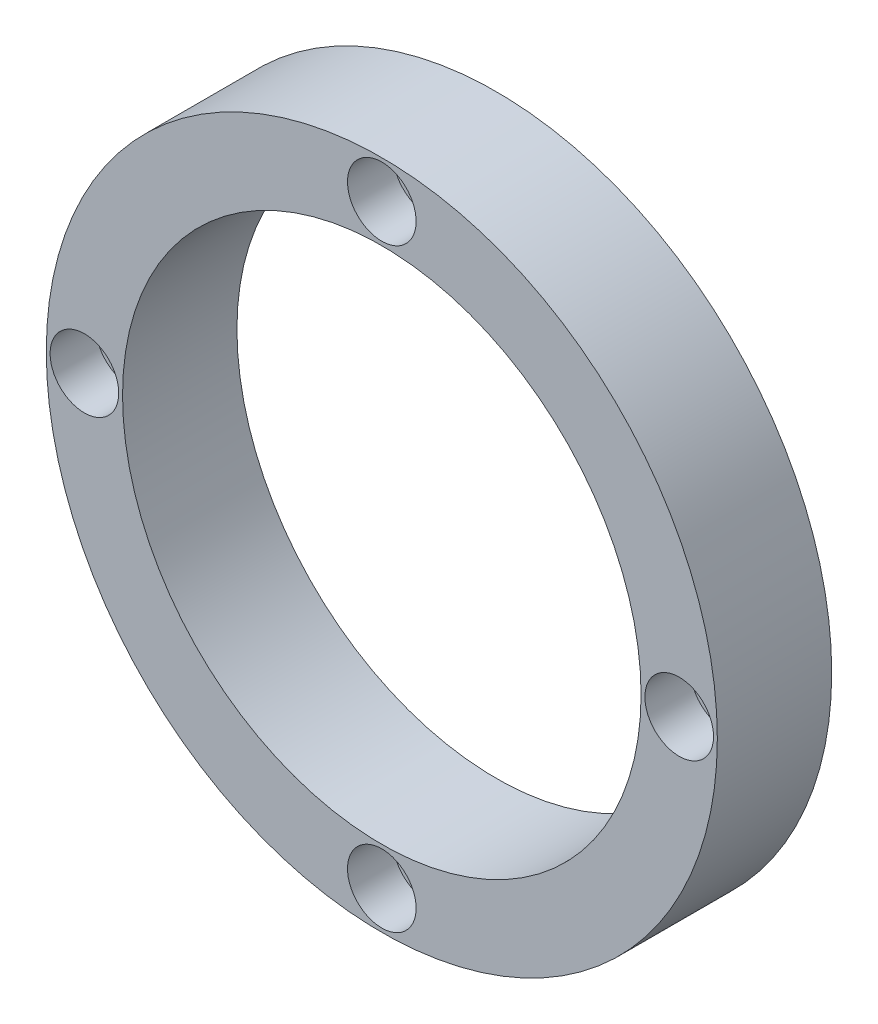
ISO-10303-21;
HEADER;
FILE_DESCRIPTION(('STEP AP214'),'2;1');
FILE_NAME('part.step','',(''),(''),'','','');
FILE_SCHEMA(('AUTOMOTIVE_DESIGN { 1 0 10303 214 1 1 1 1 }'));
ENDSEC;
DATA;
#1=APPLICATION_CONTEXT('core data for automotive mechanical design processes');
#2=APPLICATION_PROTOCOL_DEFINITION('international standard','automotive_design',2000,#1);
#3=PRODUCT_CONTEXT('',#1,'mechanical');
#4=PRODUCT('Part','Part','',(#3));
#5=PRODUCT_RELATED_PRODUCT_CATEGORY('part','',(#4));
#6=PRODUCT_DEFINITION_FORMATION('','',#4);
#7=PRODUCT_DEFINITION_CONTEXT('part definition',#1,'design');
#8=PRODUCT_DEFINITION('design','',#6,#7);
#9=PRODUCT_DEFINITION_SHAPE('','',#8);
#10=(LENGTH_UNIT() NAMED_UNIT(*) SI_UNIT(.MILLI.,.METRE.));
#11=(NAMED_UNIT(*) PLANE_ANGLE_UNIT() SI_UNIT($,.RADIAN.));
#12=(NAMED_UNIT(*) SI_UNIT($,.STERADIAN.) SOLID_ANGLE_UNIT());
#13=UNCERTAINTY_MEASURE_WITH_UNIT(LENGTH_MEASURE(1.E-05),#10,'distance_accuracy_value','');
#14=(GEOMETRIC_REPRESENTATION_CONTEXT(3) GLOBAL_UNCERTAINTY_ASSIGNED_CONTEXT((#13)) GLOBAL_UNIT_ASSIGNED_CONTEXT((#10,
#11,#12)) REPRESENTATION_CONTEXT('',''));
#15=CARTESIAN_POINT('',(0.,0.,0.));
#16=DIRECTION('',(0.,0.,1.));
#17=DIRECTION('',(1.,0.,0.));
#18=AXIS2_PLACEMENT_3D('',#15,#16,#17);
#19=CARTESIAN_POINT('',(0.,0.,15.));
#20=DIRECTION('',(0.,0.,1.));
#21=DIRECTION('',(1.,0.,0.));
#22=AXIS2_PLACEMENT_3D('',#19,#20,#21);
#23=PLANE('',#22);
#24=CARTESIAN_POINT('',(4.08503553249798E-13,39.,15.));
#25=DIRECTION('',(0.,0.,1.));
#26=DIRECTION('',(0.,1.,0.));
#27=AXIS2_PLACEMENT_3D('',#24,#25,#26);
#28=CIRCLE('',#27,4.5);
#29=CARTESIAN_POINT('',(4.55638578624774E-13,43.5,15.));
#30=VERTEX_POINT('',#29);
#31=EDGE_CURVE('E73',#30,#30,#28,.T.);
#32=ORIENTED_EDGE('',*,*,#31,.F.);
#33=EDGE_LOOP('',(#32));
#34=FACE_BOUND('',#33,.T.);
#35=CARTESIAN_POINT('',(-39.,0.,15.));
#36=DIRECTION('',(0.,0.,1.));
#37=DIRECTION('',(-1.,0.,0.));
#38=AXIS2_PLACEMENT_3D('',#35,#36,#37);
#39=CIRCLE('',#38,4.5);
#40=CARTESIAN_POINT('',(-43.5,0.,15.));
#41=VERTEX_POINT('',#40);
#42=EDGE_CURVE('E67',#41,#41,#39,.T.);
#43=ORIENTED_EDGE('',*,*,#42,.F.);
#44=EDGE_LOOP('',(#43));
#45=FACE_BOUND('',#44,.T.);
#46=CARTESIAN_POINT('',(-1.36167851083266E-13,-39.,15.));
#47=DIRECTION('',(0.,0.,1.));
#48=DIRECTION('',(0.,-1.,0.));
#49=AXIS2_PLACEMENT_3D('',#46,#47,#48);
#50=CIRCLE('',#49,4.5);
#51=CARTESIAN_POINT('',(-1.51879526208258E-13,-43.5,15.));
#52=VERTEX_POINT('',#51);
#53=EDGE_CURVE('E61',#52,#52,#50,.T.);
#54=ORIENTED_EDGE('',*,*,#53,.F.);
#55=EDGE_LOOP('',(#54));
#56=FACE_BOUND('',#55,.T.);
#57=CARTESIAN_POINT('',(39.,0.,15.));
#58=DIRECTION('',(0.,0.,1.));
#59=DIRECTION('',(1.,0.,0.));
#60=AXIS2_PLACEMENT_3D('',#57,#58,#59);
#61=CIRCLE('',#60,4.5);
#62=CARTESIAN_POINT('',(43.5,0.,15.));
#63=VERTEX_POINT('',#62);
#64=EDGE_CURVE('E49',#63,#63,#61,.T.);
#65=ORIENTED_EDGE('',*,*,#64,.F.);
#66=EDGE_LOOP('',(#65));
#67=FACE_BOUND('',#66,.T.);
#68=CARTESIAN_POINT('',(0.,0.,15.));
#69=DIRECTION('',(0.,0.,1.));
#70=DIRECTION('',(1.,0.,0.));
#71=AXIS2_PLACEMENT_3D('',#68,#69,#70);
#72=CIRCLE('',#71,44.);
#73=CARTESIAN_POINT('',(44.,0.,15.));
#74=VERTEX_POINT('',#73);
#75=EDGE_CURVE('E10',#74,#74,#72,.T.);
#76=ORIENTED_EDGE('',*,*,#75,.T.);
#77=EDGE_LOOP('',(#76));
#78=FACE_BOUND('',#77,.T.);
#79=CARTESIAN_POINT('',(0.,0.,15.));
#80=DIRECTION('',(0.,0.,1.));
#81=DIRECTION('',(1.,0.,0.));
#82=AXIS2_PLACEMENT_3D('',#79,#80,#81);
#83=CIRCLE('',#82,34.);
#84=CARTESIAN_POINT('',(34.,0.,15.));
#85=VERTEX_POINT('',#84);
#86=EDGE_CURVE('E41',#85,#85,#83,.T.);
#87=ORIENTED_EDGE('',*,*,#86,.F.);
#88=EDGE_LOOP('',(#87));
#89=FACE_BOUND('',#88,.T.);
#90=ADVANCED_FACE('F30',(#34,#45,#56,#67,#78,#89),#23,.T.);
#91=CARTESIAN_POINT('',(0.,0.,0.));
#92=DIRECTION('',(0.,0.,1.));
#93=DIRECTION('',(1.,0.,0.));
#94=AXIS2_PLACEMENT_3D('',#91,#92,#93);
#95=PLANE('',#94);
#96=CARTESIAN_POINT('',(4.08503553249798E-13,39.,0.));
#97=DIRECTION('',(0.,0.,1.));
#98=DIRECTION('',(1.,0.,0.));
#99=AXIS2_PLACEMENT_3D('',#96,#97,#98);
#100=CIRCLE('',#99,2.5);
#101=CARTESIAN_POINT('',(2.50000000000041,39.,0.));
#102=VERTEX_POINT('',#101);
#103=EDGE_CURVE('E90',#102,#102,#100,.T.);
#104=ORIENTED_EDGE('',*,*,#103,.T.);
#105=EDGE_LOOP('',(#104));
#106=FACE_BOUND('',#105,.T.);
#107=CARTESIAN_POINT('',(-39.,0.,0.));
#108=DIRECTION('',(0.,0.,1.));
#109=DIRECTION('',(1.,0.,0.));
#110=AXIS2_PLACEMENT_3D('',#107,#108,#109);
#111=CIRCLE('',#110,2.5);
#112=CARTESIAN_POINT('',(-36.5,0.,0.));
#113=VERTEX_POINT('',#112);
#114=EDGE_CURVE('E84',#113,#113,#111,.T.);
#115=ORIENTED_EDGE('',*,*,#114,.T.);
#116=EDGE_LOOP('',(#115));
#117=FACE_BOUND('',#116,.T.);
#118=CARTESIAN_POINT('',(-1.36167851083266E-13,-39.,0.));
#119=DIRECTION('',(0.,0.,1.));
#120=DIRECTION('',(1.,0.,0.));
#121=AXIS2_PLACEMENT_3D('',#118,#119,#120);
#122=CIRCLE('',#121,2.5);
#123=CARTESIAN_POINT('',(2.49999999999987,-39.,0.));
#124=VERTEX_POINT('',#123);
#125=EDGE_CURVE('E76',#124,#124,#122,.T.);
#126=ORIENTED_EDGE('',*,*,#125,.T.);
#127=EDGE_LOOP('',(#126));
#128=FACE_BOUND('',#127,.T.);
#129=CARTESIAN_POINT('',(39.,0.,0.));
#130=DIRECTION('',(0.,0.,1.));
#131=DIRECTION('',(1.,0.,0.));
#132=AXIS2_PLACEMENT_3D('',#129,#130,#131);
#133=CIRCLE('',#132,2.5);
#134=CARTESIAN_POINT('',(41.5,0.,0.));
#135=VERTEX_POINT('',#134);
#136=EDGE_CURVE('E52',#135,#135,#133,.T.);
#137=ORIENTED_EDGE('',*,*,#136,.T.);
#138=EDGE_LOOP('',(#137));
#139=FACE_BOUND('',#138,.T.);
#140=CARTESIAN_POINT('',(0.,0.,0.));
#141=DIRECTION('',(0.,0.,1.));
#142=DIRECTION('',(1.,0.,0.));
#143=AXIS2_PLACEMENT_3D('',#140,#141,#142);
#144=CIRCLE('',#143,44.);
#145=CARTESIAN_POINT('',(44.,0.,0.));
#146=VERTEX_POINT('',#145);
#147=EDGE_CURVE('E34',#146,#146,#144,.T.);
#148=ORIENTED_EDGE('',*,*,#147,.F.);
#149=EDGE_LOOP('',(#148));
#150=FACE_BOUND('',#149,.T.);
#151=CARTESIAN_POINT('',(0.,0.,0.));
#152=DIRECTION('',(0.,0.,1.));
#153=DIRECTION('',(1.,0.,0.));
#154=AXIS2_PLACEMENT_3D('',#151,#152,#153);
#155=CIRCLE('',#154,34.);
#156=CARTESIAN_POINT('',(34.,0.,0.));
#157=VERTEX_POINT('',#156);
#158=EDGE_CURVE('E43',#157,#157,#155,.T.);
#159=ORIENTED_EDGE('',*,*,#158,.T.);
#160=EDGE_LOOP('',(#159));
#161=FACE_BOUND('',#160,.T.);
#162=ADVANCED_FACE('F116',(#106,#117,#128,#139,#150,#161),#95,.F.);
#163=CARTESIAN_POINT('',(0.,0.,15.));
#164=DIRECTION('',(0.,0.,-1.));
#165=DIRECTION('',(-1.,0.,0.));
#166=AXIS2_PLACEMENT_3D('',#163,#164,#165);
#167=CYLINDRICAL_SURFACE('',#166,44.);
#168=ORIENTED_EDGE('',*,*,#75,.F.);
#169=EDGE_LOOP('',(#168));
#170=FACE_BOUND('',#169,.T.);
#171=ORIENTED_EDGE('',*,*,#147,.T.);
#172=EDGE_LOOP('',(#171));
#173=FACE_BOUND('',#172,.T.);
#174=ADVANCED_FACE('F32',(#170,#173),#167,.T.);
#175=CARTESIAN_POINT('',(0.,0.,15.));
#176=DIRECTION('',(0.,0.,-1.));
#177=DIRECTION('',(-1.,0.,0.));
#178=AXIS2_PLACEMENT_3D('',#175,#176,#177);
#179=CYLINDRICAL_SURFACE('',#178,34.);
#180=ORIENTED_EDGE('',*,*,#86,.T.);
#181=EDGE_LOOP('',(#180));
#182=FACE_BOUND('',#181,.T.);
#183=ORIENTED_EDGE('',*,*,#158,.F.);
#184=EDGE_LOOP('',(#183));
#185=FACE_BOUND('',#184,.T.);
#186=ADVANCED_FACE('F126',(#182,#185),#179,.F.);
#187=CARTESIAN_POINT('',(39.,0.,9.));
#188=DIRECTION('',(0.,0.,1.));
#189=DIRECTION('',(1.,0.,0.));
#190=AXIS2_PLACEMENT_3D('',#187,#188,#189);
#191=CYLINDRICAL_SURFACE('',#190,4.5);
#192=CARTESIAN_POINT('',(39.,0.,9.));
#193=DIRECTION('',(0.,0.,1.));
#194=DIRECTION('',(1.,0.,0.));
#195=AXIS2_PLACEMENT_3D('',#192,#193,#194);
#196=CIRCLE('',#195,4.5);
#197=CARTESIAN_POINT('',(43.5,0.,9.));
#198=VERTEX_POINT('',#197);
#199=EDGE_CURVE('E46',#198,#198,#196,.T.);
#200=ORIENTED_EDGE('',*,*,#199,.F.);
#201=EDGE_LOOP('',(#200));
#202=FACE_BOUND('',#201,.T.);
#203=ORIENTED_EDGE('',*,*,#64,.T.);
#204=EDGE_LOOP('',(#203));
#205=FACE_BOUND('',#204,.T.);
#206=ADVANCED_FACE('F129',(#202,#205),#191,.F.);
#207=CARTESIAN_POINT('',(39.,0.,9.));
#208=DIRECTION('',(0.,0.,1.));
#209=DIRECTION('',(1.,0.,0.));
#210=AXIS2_PLACEMENT_3D('',#207,#208,#209);
#211=PLANE('',#210);
#212=CARTESIAN_POINT('',(39.,0.,9.));
#213=DIRECTION('',(0.,0.,1.));
#214=DIRECTION('',(1.,0.,0.));
#215=AXIS2_PLACEMENT_3D('',#212,#213,#214);
#216=CIRCLE('',#215,2.5);
#217=CARTESIAN_POINT('',(41.5,0.,9.));
#218=VERTEX_POINT('',#217);
#219=EDGE_CURVE('E57',#218,#218,#216,.T.);
#220=ORIENTED_EDGE('',*,*,#219,.F.);
#221=EDGE_LOOP('',(#220));
#222=FACE_BOUND('',#221,.T.);
#223=ORIENTED_EDGE('',*,*,#199,.T.);
#224=EDGE_LOOP('',(#223));
#225=FACE_BOUND('',#224,.T.);
#226=ADVANCED_FACE('F143',(#222,#225),#211,.T.);
#227=CARTESIAN_POINT('',(39.,0.,-2.));
#228=DIRECTION('',(0.,0.,1.));
#229=DIRECTION('',(1.,0.,0.));
#230=AXIS2_PLACEMENT_3D('',#227,#228,#229);
#231=CYLINDRICAL_SURFACE('',#230,2.5);
#232=ORIENTED_EDGE('',*,*,#219,.T.);
#233=EDGE_LOOP('',(#232));
#234=FACE_BOUND('',#233,.T.);
#235=ORIENTED_EDGE('',*,*,#136,.F.);
#236=EDGE_LOOP('',(#235));
#237=FACE_BOUND('',#236,.T.);
#238=ADVANCED_FACE('F147',(#234,#237),#231,.F.);
#239=CARTESIAN_POINT('',(-1.36167851083266E-13,-39.,9.));
#240=DIRECTION('',(0.,0.,1.));
#241=DIRECTION('',(1.,0.,0.));
#242=AXIS2_PLACEMENT_3D('',#239,#240,#241);
#243=CYLINDRICAL_SURFACE('',#242,4.5);
#244=CARTESIAN_POINT('',(-1.36167851083266E-13,-39.,9.));
#245=DIRECTION('',(0.,0.,1.));
#246=DIRECTION('',(0.,-1.,0.));
#247=AXIS2_PLACEMENT_3D('',#244,#245,#246);
#248=CIRCLE('',#247,4.5);
#249=CARTESIAN_POINT('',(-1.51879526208258E-13,-43.5,9.));
#250=VERTEX_POINT('',#249);
#251=EDGE_CURVE('E60',#250,#250,#248,.T.);
#252=ORIENTED_EDGE('',*,*,#251,.F.);
#253=EDGE_LOOP('',(#252));
#254=FACE_BOUND('',#253,.T.);
#255=ORIENTED_EDGE('',*,*,#53,.T.);
#256=EDGE_LOOP('',(#255));
#257=FACE_BOUND('',#256,.T.);
#258=ADVANCED_FACE('F151',(#254,#257),#243,.F.);
#259=CARTESIAN_POINT('',(-1.36167851083266E-13,-39.,9.));
#260=DIRECTION('',(0.,0.,1.));
#261=DIRECTION('',(0.,-1.,0.));
#262=AXIS2_PLACEMENT_3D('',#259,#260,#261);
#263=PLANE('',#262);
#264=CARTESIAN_POINT('',(-1.36167851083266E-13,-39.,9.));
#265=DIRECTION('',(0.,0.,1.));
#266=DIRECTION('',(0.,-1.,0.));
#267=AXIS2_PLACEMENT_3D('',#264,#265,#266);
#268=CIRCLE('',#267,2.5);
#269=CARTESIAN_POINT('',(-1.44896559486039E-13,-41.5,9.));
#270=VERTEX_POINT('',#269);
#271=EDGE_CURVE('E81',#270,#270,#268,.T.);
#272=ORIENTED_EDGE('',*,*,#271,.F.);
#273=EDGE_LOOP('',(#272));
#274=FACE_BOUND('',#273,.T.);
#275=ORIENTED_EDGE('',*,*,#251,.T.);
#276=EDGE_LOOP('',(#275));
#277=FACE_BOUND('',#276,.T.);
#278=ADVANCED_FACE('F155',(#274,#277),#263,.T.);
#279=CARTESIAN_POINT('',(-39.,0.,9.));
#280=DIRECTION('',(0.,0.,1.));
#281=DIRECTION('',(1.,0.,0.));
#282=AXIS2_PLACEMENT_3D('',#279,#280,#281);
#283=CYLINDRICAL_SURFACE('',#282,4.5);
#284=CARTESIAN_POINT('',(-39.,0.,9.));
#285=DIRECTION('',(0.,0.,1.));
#286=DIRECTION('',(-1.,0.,0.));
#287=AXIS2_PLACEMENT_3D('',#284,#285,#286);
#288=CIRCLE('',#287,4.5);
#289=CARTESIAN_POINT('',(-43.5,0.,9.));
#290=VERTEX_POINT('',#289);
#291=EDGE_CURVE('E64',#290,#290,#288,.T.);
#292=ORIENTED_EDGE('',*,*,#291,.F.);
#293=EDGE_LOOP('',(#292));
#294=FACE_BOUND('',#293,.T.);
#295=ORIENTED_EDGE('',*,*,#42,.T.);
#296=EDGE_LOOP('',(#295));
#297=FACE_BOUND('',#296,.T.);
#298=ADVANCED_FACE('F159',(#294,#297),#283,.F.);
#299=CARTESIAN_POINT('',(-39.,0.,9.));
#300=DIRECTION('',(0.,0.,1.));
#301=DIRECTION('',(-1.,0.,0.));
#302=AXIS2_PLACEMENT_3D('',#299,#300,#301);
#303=PLANE('',#302);
#304=CARTESIAN_POINT('',(-39.,0.,9.));
#305=DIRECTION('',(0.,0.,1.));
#306=DIRECTION('',(-1.,0.,0.));
#307=AXIS2_PLACEMENT_3D('',#304,#305,#306);
#308=CIRCLE('',#307,2.5);
#309=CARTESIAN_POINT('',(-41.5,0.,9.));
#310=VERTEX_POINT('',#309);
#311=EDGE_CURVE('E87',#310,#310,#308,.T.);
#312=ORIENTED_EDGE('',*,*,#311,.F.);
#313=EDGE_LOOP('',(#312));
#314=FACE_BOUND('',#313,.T.);
#315=ORIENTED_EDGE('',*,*,#291,.T.);
#316=EDGE_LOOP('',(#315));
#317=FACE_BOUND('',#316,.T.);
#318=ADVANCED_FACE('F110',(#314,#317),#303,.T.);
#319=CARTESIAN_POINT('',(4.08503553249798E-13,39.,9.));
#320=DIRECTION('',(0.,0.,1.));
#321=DIRECTION('',(1.,0.,0.));
#322=AXIS2_PLACEMENT_3D('',#319,#320,#321);
#323=CYLINDRICAL_SURFACE('',#322,4.5);
#324=CARTESIAN_POINT('',(4.08503553249798E-13,39.,9.));
#325=DIRECTION('',(0.,0.,1.));
#326=DIRECTION('',(0.,1.,0.));
#327=AXIS2_PLACEMENT_3D('',#324,#325,#326);
#328=CIRCLE('',#327,4.5);
#329=CARTESIAN_POINT('',(4.55638578624774E-13,43.5,9.));
#330=VERTEX_POINT('',#329);
#331=EDGE_CURVE('E70',#330,#330,#328,.T.);
#332=ORIENTED_EDGE('',*,*,#331,.F.);
#333=EDGE_LOOP('',(#332));
#334=FACE_BOUND('',#333,.T.);
#335=ORIENTED_EDGE('',*,*,#31,.T.);
#336=EDGE_LOOP('',(#335));
#337=FACE_BOUND('',#336,.T.);
#338=ADVANCED_FACE('F104',(#334,#337),#323,.F.);
#339=CARTESIAN_POINT('',(4.08503553249798E-13,39.,9.));
#340=DIRECTION('',(0.,0.,1.));
#341=DIRECTION('',(0.,1.,0.));
#342=AXIS2_PLACEMENT_3D('',#339,#340,#341);
#343=PLANE('',#342);
#344=CARTESIAN_POINT('',(4.08503553249798E-13,39.,9.));
#345=DIRECTION('',(0.,0.,1.));
#346=DIRECTION('',(0.,1.,0.));
#347=AXIS2_PLACEMENT_3D('',#344,#345,#346);
#348=CIRCLE('',#347,2.5);
#349=CARTESIAN_POINT('',(4.34689678458118E-13,41.5,9.));
#350=VERTEX_POINT('',#349);
#351=EDGE_CURVE('E93',#350,#350,#348,.T.);
#352=ORIENTED_EDGE('',*,*,#351,.F.);
#353=EDGE_LOOP('',(#352));
#354=FACE_BOUND('',#353,.T.);
#355=ORIENTED_EDGE('',*,*,#331,.T.);
#356=EDGE_LOOP('',(#355));
#357=FACE_BOUND('',#356,.T.);
#358=ADVANCED_FACE('F100',(#354,#357),#343,.T.);
#359=CARTESIAN_POINT('',(-1.36167851083266E-13,-39.,-2.));
#360=DIRECTION('',(0.,0.,1.));
#361=DIRECTION('',(1.,0.,0.));
#362=AXIS2_PLACEMENT_3D('',#359,#360,#361);
#363=CYLINDRICAL_SURFACE('',#362,2.5);
#364=ORIENTED_EDGE('',*,*,#271,.T.);
#365=EDGE_LOOP('',(#364));
#366=FACE_BOUND('',#365,.T.);
#367=ORIENTED_EDGE('',*,*,#125,.F.);
#368=EDGE_LOOP('',(#367));
#369=FACE_BOUND('',#368,.T.);
#370=ADVANCED_FACE('F103',(#366,#369),#363,.F.);
#371=CARTESIAN_POINT('',(-39.,0.,-2.));
#372=DIRECTION('',(0.,0.,1.));
#373=DIRECTION('',(1.,0.,0.));
#374=AXIS2_PLACEMENT_3D('',#371,#372,#373);
#375=CYLINDRICAL_SURFACE('',#374,2.5);
#376=ORIENTED_EDGE('',*,*,#311,.T.);
#377=EDGE_LOOP('',(#376));
#378=FACE_BOUND('',#377,.T.);
#379=ORIENTED_EDGE('',*,*,#114,.F.);
#380=EDGE_LOOP('',(#379));
#381=FACE_BOUND('',#380,.T.);
#382=ADVANCED_FACE('F169',(#378,#381),#375,.F.);
#383=CARTESIAN_POINT('',(4.08503553249798E-13,39.,-2.));
#384=DIRECTION('',(0.,0.,1.));
#385=DIRECTION('',(1.,0.,0.));
#386=AXIS2_PLACEMENT_3D('',#383,#384,#385);
#387=CYLINDRICAL_SURFACE('',#386,2.5);
#388=ORIENTED_EDGE('',*,*,#351,.T.);
#389=EDGE_LOOP('',(#388));
#390=FACE_BOUND('',#389,.T.);
#391=ORIENTED_EDGE('',*,*,#103,.F.);
#392=EDGE_LOOP('',(#391));
#393=FACE_BOUND('',#392,.T.);
#394=ADVANCED_FACE('F97',(#390,#393),#387,.F.);
#395=CLOSED_SHELL('',(#90,#162,#174,#186,#206,#226,#238,#258,#278,#298,#318,#338,#358,#370,#382,#394));
#396=MANIFOLD_SOLID_BREP('B2',#395);
#397=ADVANCED_BREP_SHAPE_REPRESENTATION('',(#18,#396),#14);
#398=SHAPE_DEFINITION_REPRESENTATION(#9,#397);
ENDSEC;
END-ISO-10303-21;
